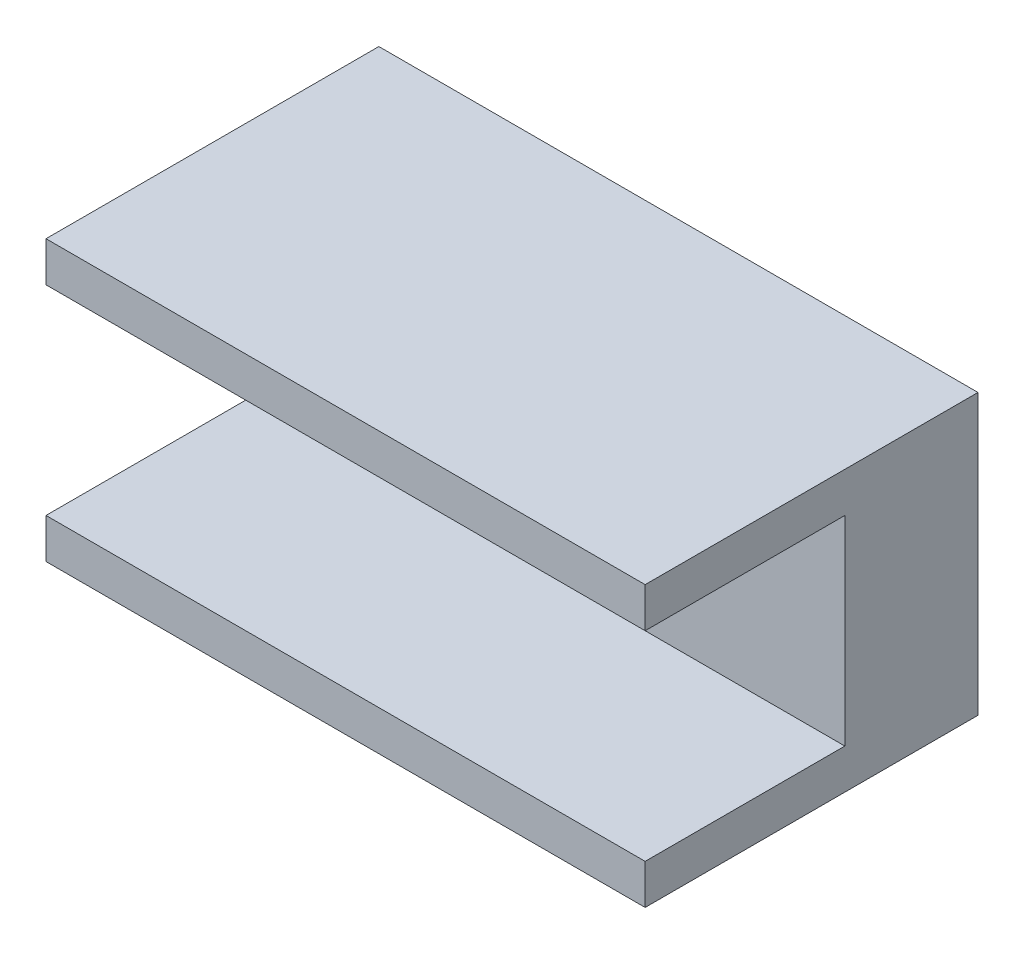
ISO-10303-21;
HEADER;
FILE_DESCRIPTION(('STEP AP214'),'2;1');
FILE_NAME('part.step','',(''),(''),'','','');
FILE_SCHEMA(('AUTOMOTIVE_DESIGN { 1 0 10303 214 1 1 1 1 }'));
ENDSEC;
DATA;
#1=APPLICATION_CONTEXT('core data for automotive mechanical design processes');
#2=APPLICATION_PROTOCOL_DEFINITION('international standard','automotive_design',2000,#1);
#3=PRODUCT_CONTEXT('',#1,'mechanical');
#4=PRODUCT('Part','Part','',(#3));
#5=PRODUCT_RELATED_PRODUCT_CATEGORY('part','',(#4));
#6=PRODUCT_DEFINITION_FORMATION('','',#4);
#7=PRODUCT_DEFINITION_CONTEXT('part definition',#1,'design');
#8=PRODUCT_DEFINITION('design','',#6,#7);
#9=PRODUCT_DEFINITION_SHAPE('','',#8);
#10=(LENGTH_UNIT() NAMED_UNIT(*) SI_UNIT(.MILLI.,.METRE.));
#11=(NAMED_UNIT(*) PLANE_ANGLE_UNIT() SI_UNIT($,.RADIAN.));
#12=(NAMED_UNIT(*) SI_UNIT($,.STERADIAN.) SOLID_ANGLE_UNIT());
#13=UNCERTAINTY_MEASURE_WITH_UNIT(LENGTH_MEASURE(1.E-05),#10,'distance_accuracy_value','');
#14=(GEOMETRIC_REPRESENTATION_CONTEXT(3) GLOBAL_UNCERTAINTY_ASSIGNED_CONTEXT((#13)) GLOBAL_UNIT_ASSIGNED_CONTEXT((#10,
#11,#12)) REPRESENTATION_CONTEXT('',''));
#15=CARTESIAN_POINT('',(0.,0.,0.));
#16=DIRECTION('',(0.,0.,1.));
#17=DIRECTION('',(1.,0.,0.));
#18=AXIS2_PLACEMENT_3D('',#15,#16,#17);
#19=CARTESIAN_POINT('',(0.,0.,25.));
#20=DIRECTION('',(0.,0.,1.));
#21=DIRECTION('',(1.,0.,0.));
#22=AXIS2_PLACEMENT_3D('',#19,#20,#21);
#23=PLANE('',#22);
#24=DIRECTION('',(-1.,0.,0.));
#25=VECTOR('',#24,1.);
#26=CARTESIAN_POINT('',(-143.379556320002,415.809627253333,25.));
#27=LINE('',#26,#25);
#28=CARTESIAN_POINT('',(-98.3795563200021,415.809627253333,25.));
#29=VERTEX_POINT('',#28);
#30=CARTESIAN_POINT('',(-143.379556320002,415.809627253333,25.));
#31=VERTEX_POINT('',#30);
#32=EDGE_CURVE('E138',#29,#31,#27,.T.);
#33=ORIENTED_EDGE('',*,*,#32,.F.);
#34=DIRECTION('',(0.,1.,0.));
#35=VECTOR('',#34,1.);
#36=CARTESIAN_POINT('',(-98.3795563200021,418.809627253333,25.));
#37=LINE('',#36,#35);
#38=CARTESIAN_POINT('',(-98.3795563200021,418.809627253333,25.));
#39=VERTEX_POINT('',#38);
#40=EDGE_CURVE('E156',#29,#39,#37,.T.);
#41=ORIENTED_EDGE('',*,*,#40,.T.);
#42=DIRECTION('',(-1.,0.,0.));
#43=VECTOR('',#42,1.);
#44=CARTESIAN_POINT('',(-143.379556320002,418.809627253333,25.));
#45=LINE('',#44,#43);
#46=CARTESIAN_POINT('',(-143.379556320002,418.809627253333,25.));
#47=VERTEX_POINT('',#46);
#48=EDGE_CURVE('E70',#39,#47,#45,.T.);
#49=ORIENTED_EDGE('',*,*,#48,.T.);
#50=DIRECTION('',(0.,-1.,0.));
#51=VECTOR('',#50,1.);
#52=CARTESIAN_POINT('',(-143.379556320002,418.809627253333,25.));
#53=LINE('',#52,#51);
#54=EDGE_CURVE('E150',#47,#31,#53,.T.);
#55=ORIENTED_EDGE('',*,*,#54,.T.);
#56=EDGE_LOOP('',(#33,#41,#49,#55));
#57=FACE_BOUND('',#56,.T.);
#58=ADVANCED_FACE('F45',(#57),#23,.T.);
#59=CARTESIAN_POINT('',(-143.379556320002,418.809627253333,25.));
#60=DIRECTION('',(1.,0.,0.));
#61=DIRECTION('',(0.,1.,0.));
#62=AXIS2_PLACEMENT_3D('',#59,#60,#61);
#63=PLANE('',#62);
#64=DIRECTION('',(0.,-1.,0.));
#65=VECTOR('',#64,1.);
#66=CARTESIAN_POINT('',(-143.379556320002,415.809627253333,10.));
#67=LINE('',#66,#65);
#68=CARTESIAN_POINT('',(-143.379556320002,415.809627253333,10.));
#69=VERTEX_POINT('',#68);
#70=CARTESIAN_POINT('',(-143.379556320002,400.809627253333,10.));
#71=VERTEX_POINT('',#70);
#72=EDGE_CURVE('E128',#69,#71,#67,.T.);
#73=ORIENTED_EDGE('',*,*,#72,.F.);
#74=DIRECTION('',(0.,0.,1.));
#75=VECTOR('',#74,1.);
#76=CARTESIAN_POINT('',(-143.379556320002,415.809627253333,10.));
#77=LINE('',#76,#75);
#78=EDGE_CURVE('E169',#69,#31,#77,.T.);
#79=ORIENTED_EDGE('',*,*,#78,.T.);
#80=ORIENTED_EDGE('',*,*,#54,.F.);
#81=DIRECTION('',(0.,0.,-1.));
#82=VECTOR('',#81,1.);
#83=CARTESIAN_POINT('',(-143.379556320002,418.809627253333,25.));
#84=LINE('',#83,#82);
#85=CARTESIAN_POINT('',(-143.379556320002,418.809627253333,0.));
#86=VERTEX_POINT('',#85);
#87=EDGE_CURVE('E163',#47,#86,#84,.T.);
#88=ORIENTED_EDGE('',*,*,#87,.T.);
#89=DIRECTION('',(0.,-1.,0.));
#90=VECTOR('',#89,1.);
#91=CARTESIAN_POINT('',(-143.379556320002,418.809627253333,0.));
#92=LINE('',#91,#90);
#93=CARTESIAN_POINT('',(-143.379556320002,397.809627253333,0.));
#94=VERTEX_POINT('',#93);
#95=EDGE_CURVE('E164',#86,#94,#92,.T.);
#96=ORIENTED_EDGE('',*,*,#95,.T.);
#97=DIRECTION('',(0.,0.,-1.));
#98=VECTOR('',#97,1.);
#99=CARTESIAN_POINT('',(-143.379556320002,397.809627253333,25.));
#100=LINE('',#99,#98);
#101=CARTESIAN_POINT('',(-143.379556320002,397.809627253333,25.));
#102=VERTEX_POINT('',#101);
#103=EDGE_CURVE('E11',#102,#94,#100,.T.);
#104=ORIENTED_EDGE('',*,*,#103,.F.);
#105=CARTESIAN_POINT('',(-143.379556320002,400.809627253333,25.));
#106=VERTEX_POINT('',#105);
#107=EDGE_CURVE('E98',#106,#102,#53,.T.);
#108=ORIENTED_EDGE('',*,*,#107,.F.);
#109=DIRECTION('',(0.,0.,1.));
#110=VECTOR('',#109,1.);
#111=CARTESIAN_POINT('',(-143.379556320002,400.809627253333,10.));
#112=LINE('',#111,#110);
#113=EDGE_CURVE('E61',#71,#106,#112,.T.);
#114=ORIENTED_EDGE('',*,*,#113,.F.);
#115=EDGE_LOOP('',(#73,#79,#80,#88,#96,#104,#108,#114));
#116=FACE_BOUND('',#115,.T.);
#117=ADVANCED_FACE('F47',(#116),#63,.F.);
#118=CARTESIAN_POINT('',(-143.379556320002,397.809627253333,25.));
#119=DIRECTION('',(0.,1.,0.));
#120=DIRECTION('',(0.,0.,1.));
#121=AXIS2_PLACEMENT_3D('',#118,#119,#120);
#122=PLANE('',#121);
#123=DIRECTION('',(1.,0.,0.));
#124=VECTOR('',#123,1.);
#125=CARTESIAN_POINT('',(-143.379556320002,397.809627253333,0.));
#126=LINE('',#125,#124);
#127=CARTESIAN_POINT('',(-98.3795563200021,397.809627253333,0.));
#128=VERTEX_POINT('',#127);
#129=EDGE_CURVE('E168',#94,#128,#126,.T.);
#130=ORIENTED_EDGE('',*,*,#129,.T.);
#131=DIRECTION('',(0.,0.,-1.));
#132=VECTOR('',#131,1.);
#133=CARTESIAN_POINT('',(-98.3795563200021,397.809627253333,25.));
#134=LINE('',#133,#132);
#135=CARTESIAN_POINT('',(-98.3795563200021,397.809627253333,25.));
#136=VERTEX_POINT('',#135);
#137=EDGE_CURVE('E54',#136,#128,#134,.T.);
#138=ORIENTED_EDGE('',*,*,#137,.F.);
#139=DIRECTION('',(1.,0.,0.));
#140=VECTOR('',#139,1.);
#141=CARTESIAN_POINT('',(-143.379556320002,397.809627253333,25.));
#142=LINE('',#141,#140);
#143=EDGE_CURVE('E153',#102,#136,#142,.T.);
#144=ORIENTED_EDGE('',*,*,#143,.F.);
#145=ORIENTED_EDGE('',*,*,#103,.T.);
#146=EDGE_LOOP('',(#130,#138,#144,#145));
#147=FACE_BOUND('',#146,.T.);
#148=ADVANCED_FACE('F219',(#147),#122,.F.);
#149=CARTESIAN_POINT('',(-98.3795563200021,418.809627253333,25.));
#150=DIRECTION('',(-1.,0.,0.));
#151=DIRECTION('',(0.,0.,1.));
#152=AXIS2_PLACEMENT_3D('',#149,#150,#151);
#153=PLANE('',#152);
#154=ORIENTED_EDGE('',*,*,#40,.F.);
#155=DIRECTION('',(0.,0.,1.));
#156=VECTOR('',#155,1.);
#157=CARTESIAN_POINT('',(-98.3795563200021,415.809627253333,10.));
#158=LINE('',#157,#156);
#159=CARTESIAN_POINT('',(-98.3795563200021,415.809627253333,10.));
#160=VERTEX_POINT('',#159);
#161=EDGE_CURVE('E145',#160,#29,#158,.T.);
#162=ORIENTED_EDGE('',*,*,#161,.F.);
#163=DIRECTION('',(0.,1.,0.));
#164=VECTOR('',#163,1.);
#165=CARTESIAN_POINT('',(-98.3795563200021,415.809627253333,10.));
#166=LINE('',#165,#164);
#167=CARTESIAN_POINT('',(-98.3795563200021,400.809627253333,10.));
#168=VERTEX_POINT('',#167);
#169=EDGE_CURVE('E127',#168,#160,#166,.T.);
#170=ORIENTED_EDGE('',*,*,#169,.F.);
#171=DIRECTION('',(0.,0.,1.));
#172=VECTOR('',#171,1.);
#173=CARTESIAN_POINT('',(-98.3795563200021,400.809627253333,10.));
#174=LINE('',#173,#172);
#175=CARTESIAN_POINT('',(-98.3795563200021,400.809627253333,25.));
#176=VERTEX_POINT('',#175);
#177=EDGE_CURVE('E123',#168,#176,#174,.T.);
#178=ORIENTED_EDGE('',*,*,#177,.T.);
#179=EDGE_CURVE('E157',#136,#176,#37,.T.);
#180=ORIENTED_EDGE('',*,*,#179,.F.);
#181=ORIENTED_EDGE('',*,*,#137,.T.);
#182=DIRECTION('',(0.,1.,0.));
#183=VECTOR('',#182,1.);
#184=CARTESIAN_POINT('',(-98.3795563200021,418.809627253333,0.));
#185=LINE('',#184,#183);
#186=CARTESIAN_POINT('',(-98.3795563200021,418.809627253333,0.));
#187=VERTEX_POINT('',#186);
#188=EDGE_CURVE('E172',#128,#187,#185,.T.);
#189=ORIENTED_EDGE('',*,*,#188,.T.);
#190=DIRECTION('',(0.,0.,-1.));
#191=VECTOR('',#190,1.);
#192=CARTESIAN_POINT('',(-98.3795563200021,418.809627253333,25.));
#193=LINE('',#192,#191);
#194=EDGE_CURVE('E179',#39,#187,#193,.T.);
#195=ORIENTED_EDGE('',*,*,#194,.F.);
#196=EDGE_LOOP('',(#154,#162,#170,#178,#180,#181,#189,#195));
#197=FACE_BOUND('',#196,.T.);
#198=ADVANCED_FACE('F188',(#197),#153,.F.);
#199=CARTESIAN_POINT('',(-143.379556320002,418.809627253333,25.));
#200=DIRECTION('',(0.,-1.,0.));
#201=DIRECTION('',(0.,0.,-1.));
#202=AXIS2_PLACEMENT_3D('',#199,#200,#201);
#203=PLANE('',#202);
#204=DIRECTION('',(-1.,0.,0.));
#205=VECTOR('',#204,1.);
#206=CARTESIAN_POINT('',(-143.379556320002,418.809627253333,0.));
#207=LINE('',#206,#205);
#208=EDGE_CURVE('E91',#187,#86,#207,.T.);
#209=ORIENTED_EDGE('',*,*,#208,.T.);
#210=ORIENTED_EDGE('',*,*,#87,.F.);
#211=ORIENTED_EDGE('',*,*,#48,.F.);
#212=ORIENTED_EDGE('',*,*,#194,.T.);
#213=EDGE_LOOP('',(#209,#210,#211,#212));
#214=FACE_BOUND('',#213,.T.);
#215=ADVANCED_FACE('F195',(#214),#203,.F.);
#216=DIRECTION('',(1.,0.,0.));
#217=VECTOR('',#216,1.);
#218=CARTESIAN_POINT('',(-143.379556320002,400.809627253333,25.));
#219=LINE('',#218,#217);
#220=EDGE_CURVE('E207',#106,#176,#219,.T.);
#221=ORIENTED_EDGE('',*,*,#220,.F.);
#222=ORIENTED_EDGE('',*,*,#107,.T.);
#223=ORIENTED_EDGE('',*,*,#143,.T.);
#224=ORIENTED_EDGE('',*,*,#179,.T.);
#225=EDGE_LOOP('',(#221,#222,#223,#224));
#226=FACE_BOUND('',#225,.T.);
#227=ADVANCED_FACE('F214',(#226),#23,.T.);
#228=CARTESIAN_POINT('',(0.,0.,0.));
#229=DIRECTION('',(0.,0.,1.));
#230=DIRECTION('',(1.,0.,0.));
#231=AXIS2_PLACEMENT_3D('',#228,#229,#230);
#232=PLANE('',#231);
#233=ORIENTED_EDGE('',*,*,#95,.F.);
#234=ORIENTED_EDGE('',*,*,#208,.F.);
#235=ORIENTED_EDGE('',*,*,#188,.F.);
#236=ORIENTED_EDGE('',*,*,#129,.F.);
#237=EDGE_LOOP('',(#233,#234,#235,#236));
#238=FACE_BOUND('',#237,.T.);
#239=ADVANCED_FACE('F193',(#238),#232,.F.);
#240=CARTESIAN_POINT('',(-143.379556320002,415.809627253333,10.));
#241=DIRECTION('',(0.,1.,0.));
#242=DIRECTION('',(0.,0.,1.));
#243=AXIS2_PLACEMENT_3D('',#240,#241,#242);
#244=PLANE('',#243);
#245=ORIENTED_EDGE('',*,*,#32,.T.);
#246=ORIENTED_EDGE('',*,*,#78,.F.);
#247=DIRECTION('',(-1.,0.,0.));
#248=VECTOR('',#247,1.);
#249=CARTESIAN_POINT('',(-143.379556320002,415.809627253333,10.));
#250=LINE('',#249,#248);
#251=EDGE_CURVE('E134',#160,#69,#250,.T.);
#252=ORIENTED_EDGE('',*,*,#251,.F.);
#253=ORIENTED_EDGE('',*,*,#161,.T.);
#254=EDGE_LOOP('',(#245,#246,#252,#253));
#255=FACE_BOUND('',#254,.T.);
#256=ADVANCED_FACE('F211',(#255),#244,.F.);
#257=CARTESIAN_POINT('',(-143.379556320002,400.809627253333,10.));
#258=DIRECTION('',(0.,-1.,0.));
#259=DIRECTION('',(0.,0.,-1.));
#260=AXIS2_PLACEMENT_3D('',#257,#258,#259);
#261=PLANE('',#260);
#262=ORIENTED_EDGE('',*,*,#220,.T.);
#263=ORIENTED_EDGE('',*,*,#177,.F.);
#264=DIRECTION('',(1.,0.,0.));
#265=VECTOR('',#264,1.);
#266=CARTESIAN_POINT('',(-143.379556320002,400.809627253333,10.));
#267=LINE('',#266,#265);
#268=EDGE_CURVE('E119',#71,#168,#267,.T.);
#269=ORIENTED_EDGE('',*,*,#268,.F.);
#270=ORIENTED_EDGE('',*,*,#113,.T.);
#271=EDGE_LOOP('',(#262,#263,#269,#270));
#272=FACE_BOUND('',#271,.T.);
#273=ADVANCED_FACE('F121',(#272),#261,.F.);
#274=CARTESIAN_POINT('',(0.,0.,10.));
#275=DIRECTION('',(0.,0.,1.));
#276=DIRECTION('',(1.,0.,0.));
#277=AXIS2_PLACEMENT_3D('',#274,#275,#276);
#278=PLANE('',#277);
#279=ORIENTED_EDGE('',*,*,#72,.T.);
#280=ORIENTED_EDGE('',*,*,#268,.T.);
#281=ORIENTED_EDGE('',*,*,#169,.T.);
#282=ORIENTED_EDGE('',*,*,#251,.T.);
#283=EDGE_LOOP('',(#279,#280,#281,#282));
#284=FACE_BOUND('',#283,.T.);
#285=ADVANCED_FACE('F132',(#284),#278,.T.);
#286=CLOSED_SHELL('',(#58,#117,#148,#198,#215,#227,#239,#256,#273,#285));
#287=MANIFOLD_SOLID_BREP('B2',#286);
#288=ADVANCED_BREP_SHAPE_REPRESENTATION('',(#18,#287),#14);
#289=SHAPE_DEFINITION_REPRESENTATION(#9,#288);
ENDSEC;
END-ISO-10303-21;
